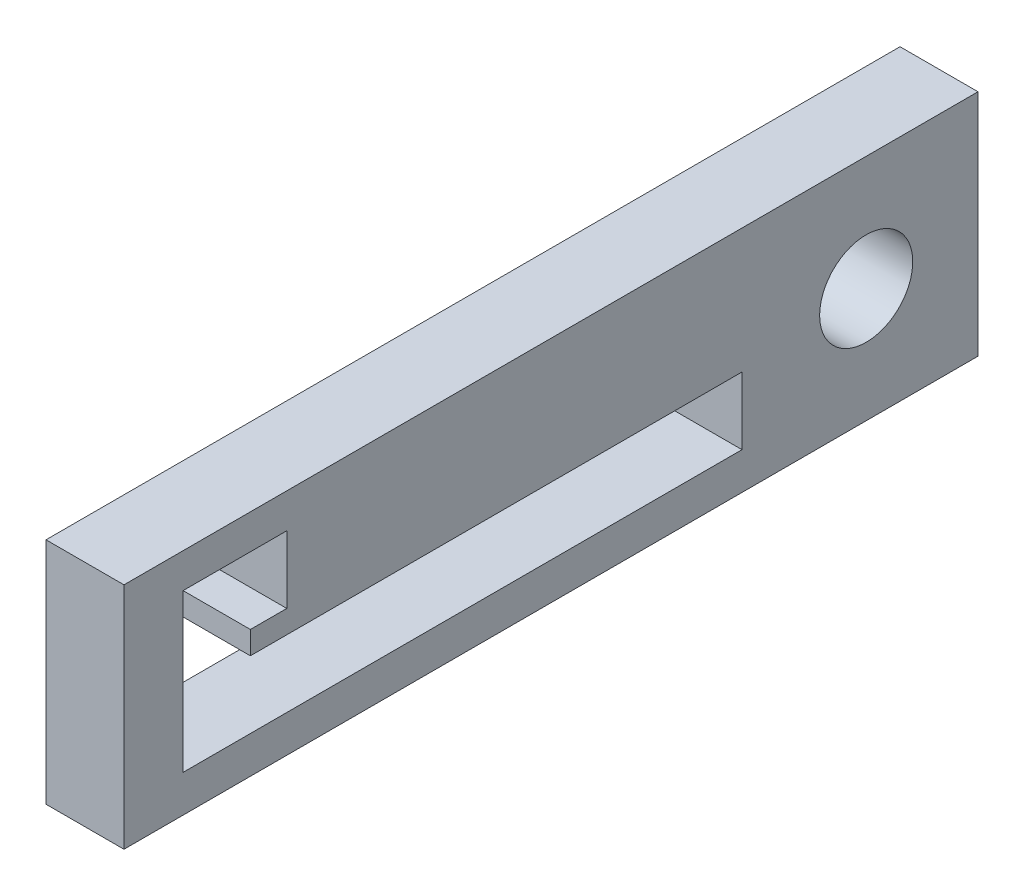
ISO-10303-21;
HEADER;
FILE_DESCRIPTION(('STEP AP214'),'2;1');
FILE_NAME('part.step','',(''),(''),'','','');
FILE_SCHEMA(('AUTOMOTIVE_DESIGN { 1 0 10303 214 1 1 1 1 }'));
ENDSEC;
DATA;
#1=APPLICATION_CONTEXT('core data for automotive mechanical design processes');
#2=APPLICATION_PROTOCOL_DEFINITION('international standard','automotive_design',2000,#1);
#3=PRODUCT_CONTEXT('',#1,'mechanical');
#4=PRODUCT('Part','Part','',(#3));
#5=PRODUCT_RELATED_PRODUCT_CATEGORY('part','',(#4));
#6=PRODUCT_DEFINITION_FORMATION('','',#4);
#7=PRODUCT_DEFINITION_CONTEXT('part definition',#1,'design');
#8=PRODUCT_DEFINITION('design','',#6,#7);
#9=PRODUCT_DEFINITION_SHAPE('','',#8);
#10=(LENGTH_UNIT() NAMED_UNIT(*) SI_UNIT(.MILLI.,.METRE.));
#11=(NAMED_UNIT(*) PLANE_ANGLE_UNIT() SI_UNIT($,.RADIAN.));
#12=(NAMED_UNIT(*) SI_UNIT($,.STERADIAN.) SOLID_ANGLE_UNIT());
#13=UNCERTAINTY_MEASURE_WITH_UNIT(LENGTH_MEASURE(1.E-05),#10,'distance_accuracy_value','');
#14=(GEOMETRIC_REPRESENTATION_CONTEXT(3) GLOBAL_UNCERTAINTY_ASSIGNED_CONTEXT((#13)) GLOBAL_UNIT_ASSIGNED_CONTEXT((#10,
#11,#12)) REPRESENTATION_CONTEXT('',''));
#15=CARTESIAN_POINT('',(0.,0.,0.));
#16=DIRECTION('',(0.,0.,1.));
#17=DIRECTION('',(1.,0.,0.));
#18=AXIS2_PLACEMENT_3D('',#15,#16,#17);
#19=CARTESIAN_POINT('',(-6.35,0.,0.));
#20=DIRECTION('',(1.,0.,0.));
#21=DIRECTION('',(0.,0.,-1.));
#22=AXIS2_PLACEMENT_3D('',#19,#20,#21);
#23=PLANE('',#22);
#24=CARTESIAN_POINT('',(-6.35,36.3261236083645,-12.2849642104093));
#25=DIRECTION('',(-1.,0.,0.));
#26=DIRECTION('',(0.,0.,1.));
#27=AXIS2_PLACEMENT_3D('',#24,#25,#26);
#28=CIRCLE('',#27,3.79234885262084);
#29=CARTESIAN_POINT('',(-6.35,36.3261236083645,-8.49261535778847));
#30=VERTEX_POINT('',#29);
#31=EDGE_CURVE('E193',#30,#30,#28,.T.);
#32=ORIENTED_EDGE('',*,*,#31,.F.);
#33=EDGE_LOOP('',(#32));
#34=FACE_BOUND('',#33,.T.);
#35=DIRECTION('',(0.,-1.,0.));
#36=VECTOR('',#35,1.);
#37=CARTESIAN_POINT('',(-6.35,26.9999148622588,-21.3900911421659));
#38=LINE('',#37,#36);
#39=CARTESIAN_POINT('',(-6.35,45.6523323544701,-21.3900911421659));
#40=VERTEX_POINT('',#39);
#41=CARTESIAN_POINT('',(-6.35,26.9999148622588,-21.3900911421659));
#42=VERTEX_POINT('',#41);
#43=EDGE_CURVE('E199',#40,#42,#38,.T.);
#44=ORIENTED_EDGE('',*,*,#43,.T.);
#45=DIRECTION('',(0.,0.,1.));
#46=VECTOR('',#45,1.);
#47=CARTESIAN_POINT('',(-6.35,26.9999148622588,-21.3900911421659));
#48=LINE('',#47,#46);
#49=CARTESIAN_POINT('',(-6.35,26.9999148622588,48.1590409832294));
#50=VERTEX_POINT('',#49);
#51=EDGE_CURVE('E202',#42,#50,#48,.T.);
#52=ORIENTED_EDGE('',*,*,#51,.T.);
#53=DIRECTION('',(0.,1.,0.));
#54=VECTOR('',#53,1.);
#55=CARTESIAN_POINT('',(-6.35,26.9999148622588,48.1590409832294));
#56=LINE('',#55,#54);
#57=CARTESIAN_POINT('',(-6.35,45.6523323544701,48.1590409832294));
#58=VERTEX_POINT('',#57);
#59=EDGE_CURVE('E205',#50,#58,#56,.T.);
#60=ORIENTED_EDGE('',*,*,#59,.T.);
#61=DIRECTION('',(0.,0.,-1.));
#62=VECTOR('',#61,1.);
#63=CARTESIAN_POINT('',(-6.35,45.6523323544701,-21.3900911421659));
#64=LINE('',#63,#62);
#65=EDGE_CURVE('E207',#58,#40,#64,.T.);
#66=ORIENTED_EDGE('',*,*,#65,.T.);
#67=EDGE_LOOP('',(#44,#52,#60,#66));
#68=FACE_BOUND('',#67,.T.);
#69=DIRECTION('',(0.,-1.,0.));
#70=VECTOR('',#69,1.);
#71=CARTESIAN_POINT('',(-6.35,35.4969669311039,-2.16979244125192));
#72=LINE('',#71,#70);
#73=CARTESIAN_POINT('',(-6.35,35.4969669311039,-2.16979244125192));
#74=VERTEX_POINT('',#73);
#75=CARTESIAN_POINT('',(-6.35,30.0184832910121,-2.16979244125192));
#76=VERTEX_POINT('',#75);
#77=EDGE_CURVE('E128',#74,#76,#72,.T.);
#78=ORIENTED_EDGE('',*,*,#77,.F.);
#79=DIRECTION('',(0.,0.,-1.));
#80=VECTOR('',#79,1.);
#81=CARTESIAN_POINT('',(-6.35,35.4969669311039,-2.16979244125192));
#82=LINE('',#81,#80);
#83=CARTESIAN_POINT('',(-6.35,35.4969669311039,37.8649790341039));
#84=VERTEX_POINT('',#83);
#85=EDGE_CURVE('E161',#84,#74,#82,.T.);
#86=ORIENTED_EDGE('',*,*,#85,.F.);
#87=DIRECTION('',(0.,-1.,0.));
#88=VECTOR('',#87,1.);
#89=CARTESIAN_POINT('',(-6.35,37.3559424356873,37.8649790341039));
#90=LINE('',#89,#88);
#91=CARTESIAN_POINT('',(-6.35,37.3559424356873,37.8649790341039));
#92=VERTEX_POINT('',#91);
#93=EDGE_CURVE('E159',#92,#84,#90,.T.);
#94=ORIENTED_EDGE('',*,*,#93,.F.);
#95=DIRECTION('',(0.,0.,1.));
#96=VECTOR('',#95,1.);
#97=CARTESIAN_POINT('',(-6.35,37.3559424356873,37.8649790341039));
#98=LINE('',#97,#96);
#99=CARTESIAN_POINT('',(-6.35,37.3559424356873,34.9001551273783));
#100=VERTEX_POINT('',#99);
#101=EDGE_CURVE('E157',#100,#92,#98,.T.);
#102=ORIENTED_EDGE('',*,*,#101,.F.);
#103=DIRECTION('',(0.,-1.,0.));
#104=VECTOR('',#103,1.);
#105=CARTESIAN_POINT('',(-6.35,37.3559424356873,34.9001551273783));
#106=LINE('',#105,#104);
#107=CARTESIAN_POINT('',(-6.35,42.8344260757791,34.9001551273783));
#108=VERTEX_POINT('',#107);
#109=EDGE_CURVE('E155',#108,#100,#106,.T.);
#110=ORIENTED_EDGE('',*,*,#109,.F.);
#111=DIRECTION('',(0.,0.,-1.));
#112=VECTOR('',#111,1.);
#113=CARTESIAN_POINT('',(-6.35,42.8344260757791,34.9001551273783));
#114=LINE('',#113,#112);
#115=CARTESIAN_POINT('',(-6.35,42.8344260757791,43.3434626741957));
#116=VERTEX_POINT('',#115);
#117=EDGE_CURVE('E151',#116,#108,#114,.T.);
#118=ORIENTED_EDGE('',*,*,#117,.F.);
#119=DIRECTION('',(0.,1.,0.));
#120=VECTOR('',#119,1.);
#121=CARTESIAN_POINT('',(-6.35,42.8344260757791,43.3434626741957));
#122=LINE('',#121,#120);
#123=CARTESIAN_POINT('',(-6.35,30.0184832910122,43.3434626741957));
#124=VERTEX_POINT('',#123);
#125=EDGE_CURVE('E149',#124,#116,#122,.T.);
#126=ORIENTED_EDGE('',*,*,#125,.F.);
#127=DIRECTION('',(0.,0.,1.));
#128=VECTOR('',#127,1.);
#129=CARTESIAN_POINT('',(-6.35,30.0184832910122,37.8649790341039));
#130=LINE('',#129,#128);
#131=EDGE_CURVE('E136',#76,#124,#130,.T.);
#132=ORIENTED_EDGE('',*,*,#131,.F.);
#133=EDGE_LOOP('',(#78,#86,#94,#102,#110,#118,#126,#132));
#134=FACE_BOUND('',#133,.T.);
#135=ADVANCED_FACE('F39',(#34,#68,#134),#23,.F.);
#136=CARTESIAN_POINT('',(0.,0.,0.));
#137=DIRECTION('',(1.,0.,0.));
#138=DIRECTION('',(0.,0.,-1.));
#139=AXIS2_PLACEMENT_3D('',#136,#137,#138);
#140=PLANE('',#139);
#141=DIRECTION('',(0.,-1.,0.));
#142=VECTOR('',#141,1.);
#143=CARTESIAN_POINT('',(0.,26.9999148622588,-21.3900911421659));
#144=LINE('',#143,#142);
#145=CARTESIAN_POINT('',(0.,45.6523323544701,-21.3900911421659));
#146=VERTEX_POINT('',#145);
#147=CARTESIAN_POINT('',(0.,26.9999148622588,-21.3900911421659));
#148=VERTEX_POINT('',#147);
#149=EDGE_CURVE('E196',#146,#148,#144,.T.);
#150=ORIENTED_EDGE('',*,*,#149,.F.);
#151=DIRECTION('',(0.,0.,-1.));
#152=VECTOR('',#151,1.);
#153=CARTESIAN_POINT('',(0.,45.6523323544701,-21.3900911421659));
#154=LINE('',#153,#152);
#155=CARTESIAN_POINT('',(0.,45.6523323544701,48.1590409832294));
#156=VERTEX_POINT('',#155);
#157=EDGE_CURVE('E203',#156,#146,#154,.T.);
#158=ORIENTED_EDGE('',*,*,#157,.F.);
#159=DIRECTION('',(0.,1.,0.));
#160=VECTOR('',#159,1.);
#161=CARTESIAN_POINT('',(0.,26.9999148622588,48.1590409832294));
#162=LINE('',#161,#160);
#163=CARTESIAN_POINT('',(0.,26.9999148622588,48.1590409832294));
#164=VERTEX_POINT('',#163);
#165=EDGE_CURVE('E214',#164,#156,#162,.T.);
#166=ORIENTED_EDGE('',*,*,#165,.F.);
#167=DIRECTION('',(0.,0.,1.));
#168=VECTOR('',#167,1.);
#169=CARTESIAN_POINT('',(0.,26.9999148622588,-21.3900911421659));
#170=LINE('',#169,#168);
#171=EDGE_CURVE('E212',#148,#164,#170,.T.);
#172=ORIENTED_EDGE('',*,*,#171,.F.);
#173=EDGE_LOOP('',(#150,#158,#166,#172));
#174=FACE_BOUND('',#173,.T.);
#175=CARTESIAN_POINT('',(0.,36.3261236083645,-12.2849642104093));
#176=DIRECTION('',(-1.,0.,0.));
#177=DIRECTION('',(0.,0.,1.));
#178=AXIS2_PLACEMENT_3D('',#175,#176,#177);
#179=CIRCLE('',#178,3.79234885262084);
#180=CARTESIAN_POINT('',(0.,36.3261236083645,-8.49261535778847));
#181=VERTEX_POINT('',#180);
#182=EDGE_CURVE('E144',#181,#181,#179,.T.);
#183=ORIENTED_EDGE('',*,*,#182,.T.);
#184=EDGE_LOOP('',(#183));
#185=FACE_BOUND('',#184,.T.);
#186=DIRECTION('',(0.,0.,-1.));
#187=VECTOR('',#186,1.);
#188=CARTESIAN_POINT('',(0.,35.4969669311039,-2.16979244125192));
#189=LINE('',#188,#187);
#190=CARTESIAN_POINT('',(0.,35.4969669311039,37.8649790341039));
#191=VERTEX_POINT('',#190);
#192=CARTESIAN_POINT('',(0.,35.4969669311039,-2.16979244125192));
#193=VERTEX_POINT('',#192);
#194=EDGE_CURVE('E137',#191,#193,#189,.T.);
#195=ORIENTED_EDGE('',*,*,#194,.T.);
#196=DIRECTION('',(0.,-1.,0.));
#197=VECTOR('',#196,1.);
#198=CARTESIAN_POINT('',(0.,35.4969669311039,-2.16979244125192));
#199=LINE('',#198,#197);
#200=CARTESIAN_POINT('',(0.,30.0184832910121,-2.16979244125192));
#201=VERTEX_POINT('',#200);
#202=EDGE_CURVE('E62',#193,#201,#199,.T.);
#203=ORIENTED_EDGE('',*,*,#202,.T.);
#204=DIRECTION('',(0.,0.,1.));
#205=VECTOR('',#204,1.);
#206=CARTESIAN_POINT('',(0.,30.0184832910122,37.8649790341039));
#207=LINE('',#206,#205);
#208=CARTESIAN_POINT('',(0.,30.0184832910122,43.3434626741957));
#209=VERTEX_POINT('',#208);
#210=EDGE_CURVE('E143',#201,#209,#207,.T.);
#211=ORIENTED_EDGE('',*,*,#210,.T.);
#212=DIRECTION('',(0.,1.,0.));
#213=VECTOR('',#212,1.);
#214=CARTESIAN_POINT('',(0.,42.8344260757791,43.3434626741957));
#215=LINE('',#214,#213);
#216=CARTESIAN_POINT('',(0.,42.8344260757791,43.3434626741957));
#217=VERTEX_POINT('',#216);
#218=EDGE_CURVE('E165',#209,#217,#215,.T.);
#219=ORIENTED_EDGE('',*,*,#218,.T.);
#220=DIRECTION('',(0.,0.,-1.));
#221=VECTOR('',#220,1.);
#222=CARTESIAN_POINT('',(0.,42.8344260757791,34.9001551273783));
#223=LINE('',#222,#221);
#224=CARTESIAN_POINT('',(0.,42.8344260757791,34.9001551273783));
#225=VERTEX_POINT('',#224);
#226=EDGE_CURVE('E168',#217,#225,#223,.T.);
#227=ORIENTED_EDGE('',*,*,#226,.T.);
#228=DIRECTION('',(0.,-1.,0.));
#229=VECTOR('',#228,1.);
#230=CARTESIAN_POINT('',(0.,37.3559424356873,34.9001551273783));
#231=LINE('',#230,#229);
#232=CARTESIAN_POINT('',(0.,37.3559424356873,34.9001551273783));
#233=VERTEX_POINT('',#232);
#234=EDGE_CURVE('E171',#225,#233,#231,.T.);
#235=ORIENTED_EDGE('',*,*,#234,.T.);
#236=DIRECTION('',(0.,0.,1.));
#237=VECTOR('',#236,1.);
#238=CARTESIAN_POINT('',(0.,37.3559424356873,37.8649790341039));
#239=LINE('',#238,#237);
#240=CARTESIAN_POINT('',(0.,37.3559424356873,37.8649790341039));
#241=VERTEX_POINT('',#240);
#242=EDGE_CURVE('E174',#233,#241,#239,.T.);
#243=ORIENTED_EDGE('',*,*,#242,.T.);
#244=DIRECTION('',(0.,-1.,0.));
#245=VECTOR('',#244,1.);
#246=CARTESIAN_POINT('',(0.,37.3559424356873,37.8649790341039));
#247=LINE('',#246,#245);
#248=EDGE_CURVE('E177',#241,#191,#247,.T.);
#249=ORIENTED_EDGE('',*,*,#248,.T.);
#250=EDGE_LOOP('',(#195,#203,#211,#219,#227,#235,#243,#249));
#251=FACE_BOUND('',#250,.T.);
#252=ADVANCED_FACE('F232',(#174,#185,#251),#140,.T.);
#253=CARTESIAN_POINT('',(-6.35,26.9999148622588,-21.3900911421659));
#254=DIRECTION('',(0.,0.,1.));
#255=DIRECTION('',(1.,0.,0.));
#256=AXIS2_PLACEMENT_3D('',#253,#254,#255);
#257=PLANE('',#256);
#258=ORIENTED_EDGE('',*,*,#149,.T.);
#259=DIRECTION('',(1.,0.,0.));
#260=VECTOR('',#259,1.);
#261=CARTESIAN_POINT('',(-6.35,26.9999148622588,-21.3900911421659));
#262=LINE('',#261,#260);
#263=EDGE_CURVE('E11',#42,#148,#262,.T.);
#264=ORIENTED_EDGE('',*,*,#263,.F.);
#265=ORIENTED_EDGE('',*,*,#43,.F.);
#266=DIRECTION('',(1.,0.,0.));
#267=VECTOR('',#266,1.);
#268=CARTESIAN_POINT('',(-6.35,45.6523323544701,-21.3900911421659));
#269=LINE('',#268,#267);
#270=EDGE_CURVE('E209',#40,#146,#269,.T.);
#271=ORIENTED_EDGE('',*,*,#270,.T.);
#272=EDGE_LOOP('',(#258,#264,#265,#271));
#273=FACE_BOUND('',#272,.T.);
#274=ADVANCED_FACE('F41',(#273),#257,.F.);
#275=CARTESIAN_POINT('',(-6.35,26.9999148622588,-21.3900911421659));
#276=DIRECTION('',(0.,1.,0.));
#277=DIRECTION('',(0.,0.,1.));
#278=AXIS2_PLACEMENT_3D('',#275,#276,#277);
#279=PLANE('',#278);
#280=ORIENTED_EDGE('',*,*,#171,.T.);
#281=DIRECTION('',(1.,0.,0.));
#282=VECTOR('',#281,1.);
#283=CARTESIAN_POINT('',(-6.35,26.9999148622588,48.1590409832294));
#284=LINE('',#283,#282);
#285=EDGE_CURVE('E47',#50,#164,#284,.T.);
#286=ORIENTED_EDGE('',*,*,#285,.F.);
#287=ORIENTED_EDGE('',*,*,#51,.F.);
#288=ORIENTED_EDGE('',*,*,#263,.T.);
#289=EDGE_LOOP('',(#280,#286,#287,#288));
#290=FACE_BOUND('',#289,.T.);
#291=ADVANCED_FACE('F242',(#290),#279,.F.);
#292=CARTESIAN_POINT('',(-6.35,26.9999148622588,48.1590409832294));
#293=DIRECTION('',(0.,0.,-1.));
#294=DIRECTION('',(-1.,0.,0.));
#295=AXIS2_PLACEMENT_3D('',#292,#293,#294);
#296=PLANE('',#295);
#297=ORIENTED_EDGE('',*,*,#165,.T.);
#298=DIRECTION('',(1.,0.,0.));
#299=VECTOR('',#298,1.);
#300=CARTESIAN_POINT('',(-6.35,45.6523323544701,48.1590409832294));
#301=LINE('',#300,#299);
#302=EDGE_CURVE('E219',#58,#156,#301,.T.);
#303=ORIENTED_EDGE('',*,*,#302,.F.);
#304=ORIENTED_EDGE('',*,*,#59,.F.);
#305=ORIENTED_EDGE('',*,*,#285,.T.);
#306=EDGE_LOOP('',(#297,#303,#304,#305));
#307=FACE_BOUND('',#306,.T.);
#308=ADVANCED_FACE('F226',(#307),#296,.F.);
#309=CARTESIAN_POINT('',(-6.35,45.6523323544701,-21.3900911421659));
#310=DIRECTION('',(0.,-1.,0.));
#311=DIRECTION('',(0.,0.,-1.));
#312=AXIS2_PLACEMENT_3D('',#309,#310,#311);
#313=PLANE('',#312);
#314=ORIENTED_EDGE('',*,*,#157,.T.);
#315=ORIENTED_EDGE('',*,*,#270,.F.);
#316=ORIENTED_EDGE('',*,*,#65,.F.);
#317=ORIENTED_EDGE('',*,*,#302,.T.);
#318=EDGE_LOOP('',(#314,#315,#316,#317));
#319=FACE_BOUND('',#318,.T.);
#320=ADVANCED_FACE('F236',(#319),#313,.F.);
#321=CARTESIAN_POINT('',(-6.35,36.3261236083645,-12.2849642104093));
#322=DIRECTION('',(1.,0.,0.));
#323=DIRECTION('',(0.,0.,-1.));
#324=AXIS2_PLACEMENT_3D('',#321,#322,#323);
#325=CYLINDRICAL_SURFACE('',#324,3.79234885262084);
#326=ORIENTED_EDGE('',*,*,#31,.T.);
#327=EDGE_LOOP('',(#326));
#328=FACE_BOUND('',#327,.T.);
#329=ORIENTED_EDGE('',*,*,#182,.F.);
#330=EDGE_LOOP('',(#329));
#331=FACE_BOUND('',#330,.T.);
#332=ADVANCED_FACE('F258',(#328,#331),#325,.F.);
#333=CARTESIAN_POINT('',(-6.35,35.4969669311039,-2.16979244125192));
#334=DIRECTION('',(0.,0.,1.));
#335=DIRECTION('',(0.,-1.,0.));
#336=AXIS2_PLACEMENT_3D('',#333,#334,#335);
#337=PLANE('',#336);
#338=ORIENTED_EDGE('',*,*,#202,.F.);
#339=DIRECTION('',(1.,0.,0.));
#340=VECTOR('',#339,1.);
#341=CARTESIAN_POINT('',(-6.35,35.4969669311039,-2.16979244125192));
#342=LINE('',#341,#340);
#343=EDGE_CURVE('E132',#74,#193,#342,.T.);
#344=ORIENTED_EDGE('',*,*,#343,.F.);
#345=ORIENTED_EDGE('',*,*,#77,.T.);
#346=DIRECTION('',(1.,0.,0.));
#347=VECTOR('',#346,1.);
#348=CARTESIAN_POINT('',(-6.35,30.0184832910121,-2.16979244125192));
#349=LINE('',#348,#347);
#350=EDGE_CURVE('E131',#76,#201,#349,.T.);
#351=ORIENTED_EDGE('',*,*,#350,.T.);
#352=EDGE_LOOP('',(#338,#344,#345,#351));
#353=FACE_BOUND('',#352,.T.);
#354=ADVANCED_FACE('F130',(#353),#337,.T.);
#355=CARTESIAN_POINT('',(-6.35,30.0184832910122,37.8649790341039));
#356=DIRECTION('',(0.,1.,0.));
#357=DIRECTION('',(0.,0.,1.));
#358=AXIS2_PLACEMENT_3D('',#355,#356,#357);
#359=PLANE('',#358);
#360=ORIENTED_EDGE('',*,*,#210,.F.);
#361=ORIENTED_EDGE('',*,*,#350,.F.);
#362=ORIENTED_EDGE('',*,*,#131,.T.);
#363=DIRECTION('',(1.,0.,0.));
#364=VECTOR('',#363,1.);
#365=CARTESIAN_POINT('',(-6.35,30.0184832910122,43.3434626741957));
#366=LINE('',#365,#364);
#367=EDGE_CURVE('E145',#124,#209,#366,.T.);
#368=ORIENTED_EDGE('',*,*,#367,.T.);
#369=EDGE_LOOP('',(#360,#361,#362,#368));
#370=FACE_BOUND('',#369,.T.);
#371=ADVANCED_FACE('F140',(#370),#359,.T.);
#372=CARTESIAN_POINT('',(-6.35,42.8344260757791,43.3434626741957));
#373=DIRECTION('',(0.,0.,-1.));
#374=DIRECTION('',(-1.,0.,0.));
#375=AXIS2_PLACEMENT_3D('',#372,#373,#374);
#376=PLANE('',#375);
#377=ORIENTED_EDGE('',*,*,#218,.F.);
#378=ORIENTED_EDGE('',*,*,#367,.F.);
#379=ORIENTED_EDGE('',*,*,#125,.T.);
#380=DIRECTION('',(1.,0.,0.));
#381=VECTOR('',#380,1.);
#382=CARTESIAN_POINT('',(-6.35,42.8344260757791,43.3434626741957));
#383=LINE('',#382,#381);
#384=EDGE_CURVE('E190',#116,#217,#383,.T.);
#385=ORIENTED_EDGE('',*,*,#384,.T.);
#386=EDGE_LOOP('',(#377,#378,#379,#385));
#387=FACE_BOUND('',#386,.T.);
#388=ADVANCED_FACE('F294',(#387),#376,.T.);
#389=CARTESIAN_POINT('',(-6.35,42.8344260757791,34.9001551273783));
#390=DIRECTION('',(0.,-1.,0.));
#391=DIRECTION('',(0.,0.,-1.));
#392=AXIS2_PLACEMENT_3D('',#389,#390,#391);
#393=PLANE('',#392);
#394=ORIENTED_EDGE('',*,*,#226,.F.);
#395=ORIENTED_EDGE('',*,*,#384,.F.);
#396=ORIENTED_EDGE('',*,*,#117,.T.);
#397=DIRECTION('',(1.,0.,0.));
#398=VECTOR('',#397,1.);
#399=CARTESIAN_POINT('',(-6.35,42.8344260757791,34.9001551273783));
#400=LINE('',#399,#398);
#401=EDGE_CURVE('E188',#108,#225,#400,.T.);
#402=ORIENTED_EDGE('',*,*,#401,.T.);
#403=EDGE_LOOP('',(#394,#395,#396,#402));
#404=FACE_BOUND('',#403,.T.);
#405=ADVANCED_FACE('F291',(#404),#393,.T.);
#406=CARTESIAN_POINT('',(-6.35,37.3559424356873,34.9001551273783));
#407=DIRECTION('',(0.,0.,1.));
#408=DIRECTION('',(1.,0.,0.));
#409=AXIS2_PLACEMENT_3D('',#406,#407,#408);
#410=PLANE('',#409);
#411=ORIENTED_EDGE('',*,*,#234,.F.);
#412=ORIENTED_EDGE('',*,*,#401,.F.);
#413=ORIENTED_EDGE('',*,*,#109,.T.);
#414=DIRECTION('',(1.,0.,0.));
#415=VECTOR('',#414,1.);
#416=CARTESIAN_POINT('',(-6.35,37.3559424356873,34.9001551273783));
#417=LINE('',#416,#415);
#418=EDGE_CURVE('E186',#100,#233,#417,.T.);
#419=ORIENTED_EDGE('',*,*,#418,.T.);
#420=EDGE_LOOP('',(#411,#412,#413,#419));
#421=FACE_BOUND('',#420,.T.);
#422=ADVANCED_FACE('F286',(#421),#410,.T.);
#423=CARTESIAN_POINT('',(-6.35,37.3559424356873,37.8649790341039));
#424=DIRECTION('',(0.,1.,0.));
#425=DIRECTION('',(0.,0.,1.));
#426=AXIS2_PLACEMENT_3D('',#423,#424,#425);
#427=PLANE('',#426);
#428=ORIENTED_EDGE('',*,*,#242,.F.);
#429=ORIENTED_EDGE('',*,*,#418,.F.);
#430=ORIENTED_EDGE('',*,*,#101,.T.);
#431=DIRECTION('',(1.,0.,0.));
#432=VECTOR('',#431,1.);
#433=CARTESIAN_POINT('',(-6.35,37.3559424356873,37.8649790341039));
#434=LINE('',#433,#432);
#435=EDGE_CURVE('E184',#92,#241,#434,.T.);
#436=ORIENTED_EDGE('',*,*,#435,.T.);
#437=EDGE_LOOP('',(#428,#429,#430,#436));
#438=FACE_BOUND('',#437,.T.);
#439=ADVANCED_FACE('F282',(#438),#427,.T.);
#440=CARTESIAN_POINT('',(-6.35,37.3559424356873,37.8649790341039));
#441=DIRECTION('',(0.,0.,1.));
#442=DIRECTION('',(1.,0.,0.));
#443=AXIS2_PLACEMENT_3D('',#440,#441,#442);
#444=PLANE('',#443);
#445=ORIENTED_EDGE('',*,*,#248,.F.);
#446=ORIENTED_EDGE('',*,*,#435,.F.);
#447=ORIENTED_EDGE('',*,*,#93,.T.);
#448=DIRECTION('',(1.,0.,0.));
#449=VECTOR('',#448,1.);
#450=CARTESIAN_POINT('',(-6.35,35.4969669311039,37.8649790341039));
#451=LINE('',#450,#449);
#452=EDGE_CURVE('E54',#84,#191,#451,.T.);
#453=ORIENTED_EDGE('',*,*,#452,.T.);
#454=EDGE_LOOP('',(#445,#446,#447,#453));
#455=FACE_BOUND('',#454,.T.);
#456=ADVANCED_FACE('F279',(#455),#444,.T.);
#457=CARTESIAN_POINT('',(-6.35,35.4969669311039,-2.16979244125192));
#458=DIRECTION('',(0.,-1.,0.));
#459=DIRECTION('',(0.,0.,-1.));
#460=AXIS2_PLACEMENT_3D('',#457,#458,#459);
#461=PLANE('',#460);
#462=ORIENTED_EDGE('',*,*,#194,.F.);
#463=ORIENTED_EDGE('',*,*,#452,.F.);
#464=ORIENTED_EDGE('',*,*,#85,.T.);
#465=ORIENTED_EDGE('',*,*,#343,.T.);
#466=EDGE_LOOP('',(#462,#463,#464,#465));
#467=FACE_BOUND('',#466,.T.);
#468=ADVANCED_FACE('F273',(#467),#461,.T.);
#469=CLOSED_SHELL('',(#135,#252,#274,#291,#308,#320,#332,#354,#371,#388,#405,#422,#439,#456,#468));
#470=MANIFOLD_SOLID_BREP('B2',#469);
#471=ADVANCED_BREP_SHAPE_REPRESENTATION('',(#18,#470),#14);
#472=SHAPE_DEFINITION_REPRESENTATION(#9,#471);
ENDSEC;
END-ISO-10303-21;
